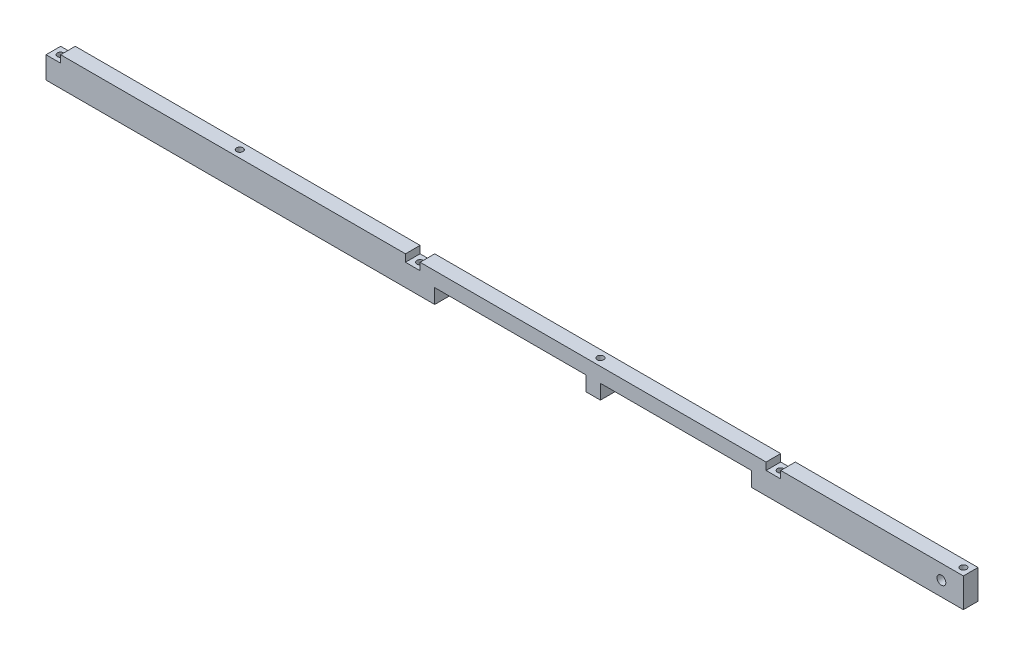
ISO-10303-21;
HEADER;
FILE_DESCRIPTION(('STEP AP214'),'2;1');
FILE_NAME('part.step','',(''),(''),'','','');
FILE_SCHEMA(('AUTOMOTIVE_DESIGN { 1 0 10303 214 1 1 1 1 }'));
ENDSEC;
DATA;
#1=APPLICATION_CONTEXT('core data for automotive mechanical design processes');
#2=APPLICATION_PROTOCOL_DEFINITION('international standard','automotive_design',2000,#1);
#3=PRODUCT_CONTEXT('',#1,'mechanical');
#4=PRODUCT('Part','Part','',(#3));
#5=PRODUCT_RELATED_PRODUCT_CATEGORY('part','',(#4));
#6=PRODUCT_DEFINITION_FORMATION('','',#4);
#7=PRODUCT_DEFINITION_CONTEXT('part definition',#1,'design');
#8=PRODUCT_DEFINITION('design','',#6,#7);
#9=PRODUCT_DEFINITION_SHAPE('','',#8);
#10=(LENGTH_UNIT() NAMED_UNIT(*) SI_UNIT(.MILLI.,.METRE.));
#11=(NAMED_UNIT(*) PLANE_ANGLE_UNIT() SI_UNIT($,.RADIAN.));
#12=(NAMED_UNIT(*) SI_UNIT($,.STERADIAN.) SOLID_ANGLE_UNIT());
#13=UNCERTAINTY_MEASURE_WITH_UNIT(LENGTH_MEASURE(1.E-05),#10,'distance_accuracy_value','');
#14=(GEOMETRIC_REPRESENTATION_CONTEXT(3) GLOBAL_UNCERTAINTY_ASSIGNED_CONTEXT((#13)) GLOBAL_UNIT_ASSIGNED_CONTEXT((#10,
#11,#12)) REPRESENTATION_CONTEXT('',''));
#15=CARTESIAN_POINT('',(0.,0.,0.));
#16=DIRECTION('',(0.,0.,1.));
#17=DIRECTION('',(1.,0.,0.));
#18=AXIS2_PLACEMENT_3D('',#15,#16,#17);
#19=CARTESIAN_POINT('',(398.018,0.,0.));
#20=DIRECTION('',(0.,0.,-1.));
#21=DIRECTION('',(-1.,0.,0.));
#22=AXIS2_PLACEMENT_3D('',#19,#20,#21);
#23=PLANE('',#22);
#24=CARTESIAN_POINT('',(388.493,6.35,0.));
#25=DIRECTION('',(0.,0.,1.));
#26=DIRECTION('',(1.,0.,0.));
#27=AXIS2_PLACEMENT_3D('',#24,#25,#26);
#28=CIRCLE('',#27,1.89865);
#29=CARTESIAN_POINT('',(390.39165,6.35,0.));
#30=VERTEX_POINT('',#29);
#31=EDGE_CURVE('E234',#30,#30,#28,.T.);
#32=ORIENTED_EDGE('',*,*,#31,.F.);
#33=EDGE_LOOP('',(#32));
#34=FACE_BOUND('',#33,.T.);
#35=DIRECTION('',(0.,1.,0.));
#36=VECTOR('',#35,1.);
#37=CARTESIAN_POINT('',(240.538,-1.05138120432002E-12,0.));
#38=LINE('',#37,#36);
#39=CARTESIAN_POINT('',(240.538,0.,0.));
#40=VERTEX_POINT('',#39);
#41=CARTESIAN_POINT('',(240.538,6.34999999999999,0.));
#42=VERTEX_POINT('',#41);
#43=EDGE_CURVE('E188',#40,#42,#38,.T.);
#44=ORIENTED_EDGE('',*,*,#43,.T.);
#45=DIRECTION('',(-1.,0.,0.));
#46=VECTOR('',#45,1.);
#47=CARTESIAN_POINT('',(0.,6.34999999999996,0.));
#48=LINE('',#47,#46);
#49=CARTESIAN_POINT('',(306.07,6.35,0.));
#50=VERTEX_POINT('',#49);
#51=EDGE_CURVE('E198',#50,#42,#48,.T.);
#52=ORIENTED_EDGE('',*,*,#51,.F.);
#53=DIRECTION('',(0.,1.,0.));
#54=VECTOR('',#53,1.);
#55=CARTESIAN_POINT('',(306.07,0.,0.));
#56=LINE('',#55,#54);
#57=CARTESIAN_POINT('',(306.07,0.,0.));
#58=VERTEX_POINT('',#57);
#59=EDGE_CURVE('E203',#58,#50,#56,.T.);
#60=ORIENTED_EDGE('',*,*,#59,.F.);
#61=DIRECTION('',(-1.,0.,0.));
#62=VECTOR('',#61,1.);
#63=CARTESIAN_POINT('',(398.018,0.,0.));
#64=LINE('',#63,#62);
#65=CARTESIAN_POINT('',(398.018,0.,0.));
#66=VERTEX_POINT('',#65);
#67=EDGE_CURVE('E368',#66,#58,#64,.T.);
#68=ORIENTED_EDGE('',*,*,#67,.F.);
#69=DIRECTION('',(0.,-1.,0.));
#70=VECTOR('',#69,1.);
#71=CARTESIAN_POINT('',(398.018,0.,0.));
#72=LINE('',#71,#70);
#73=CARTESIAN_POINT('',(398.018,12.7,0.));
#74=VERTEX_POINT('',#73);
#75=EDGE_CURVE('E335',#74,#66,#72,.T.);
#76=ORIENTED_EDGE('',*,*,#75,.F.);
#77=DIRECTION('',(-1.,0.,0.));
#78=VECTOR('',#77,1.);
#79=CARTESIAN_POINT('',(398.018,12.7,0.));
#80=LINE('',#79,#78);
#81=CARTESIAN_POINT('',(318.77,12.7,0.));
#82=VERTEX_POINT('',#81);
#83=EDGE_CURVE('E353',#74,#82,#80,.T.);
#84=ORIENTED_EDGE('',*,*,#83,.T.);
#85=DIRECTION('',(0.,1.,0.));
#86=VECTOR('',#85,1.);
#87=CARTESIAN_POINT('',(318.77,9.525,0.));
#88=LINE('',#87,#86);
#89=CARTESIAN_POINT('',(318.77,9.525,0.));
#90=VERTEX_POINT('',#89);
#91=EDGE_CURVE('E296',#90,#82,#88,.T.);
#92=ORIENTED_EDGE('',*,*,#91,.F.);
#93=DIRECTION('',(1.,0.,0.));
#94=VECTOR('',#93,1.);
#95=CARTESIAN_POINT('',(312.42,9.525,0.));
#96=LINE('',#95,#94);
#97=CARTESIAN_POINT('',(312.42,9.525,0.));
#98=VERTEX_POINT('',#97);
#99=EDGE_CURVE('E289',#98,#90,#96,.T.);
#100=ORIENTED_EDGE('',*,*,#99,.F.);
#101=DIRECTION('',(0.,-1.,0.));
#102=VECTOR('',#101,1.);
#103=CARTESIAN_POINT('',(312.42,9.525,0.));
#104=LINE('',#103,#102);
#105=CARTESIAN_POINT('',(312.42,12.7,0.));
#106=VERTEX_POINT('',#105);
#107=EDGE_CURVE('E298',#106,#98,#104,.T.);
#108=ORIENTED_EDGE('',*,*,#107,.F.);
#109=CARTESIAN_POINT('',(162.306,12.7,0.));
#110=VERTEX_POINT('',#109);
#111=EDGE_CURVE('E357',#106,#110,#80,.T.);
#112=ORIENTED_EDGE('',*,*,#111,.T.);
#113=DIRECTION('',(0.,1.,0.));
#114=VECTOR('',#113,1.);
#115=CARTESIAN_POINT('',(162.306,9.52500000000001,0.));
#116=LINE('',#115,#114);
#117=CARTESIAN_POINT('',(162.306,9.52500000000001,0.));
#118=VERTEX_POINT('',#117);
#119=EDGE_CURVE('E274',#118,#110,#116,.T.);
#120=ORIENTED_EDGE('',*,*,#119,.F.);
#121=DIRECTION('',(1.,0.,0.));
#122=VECTOR('',#121,1.);
#123=CARTESIAN_POINT('',(155.956,9.52500000000001,0.));
#124=LINE('',#123,#122);
#125=CARTESIAN_POINT('',(155.956,9.52500000000001,0.));
#126=VERTEX_POINT('',#125);
#127=EDGE_CURVE('E267',#126,#118,#124,.T.);
#128=ORIENTED_EDGE('',*,*,#127,.F.);
#129=DIRECTION('',(0.,-1.,0.));
#130=VECTOR('',#129,1.);
#131=CARTESIAN_POINT('',(155.956,9.52500000000001,0.));
#132=LINE('',#131,#130);
#133=CARTESIAN_POINT('',(155.956,12.7,0.));
#134=VERTEX_POINT('',#133);
#135=EDGE_CURVE('E276',#134,#126,#132,.T.);
#136=ORIENTED_EDGE('',*,*,#135,.F.);
#137=CARTESIAN_POINT('',(6.34999999999999,12.7,0.));
#138=VERTEX_POINT('',#137);
#139=EDGE_CURVE('E345',#134,#138,#80,.T.);
#140=ORIENTED_EDGE('',*,*,#139,.T.);
#141=DIRECTION('',(0.,1.,0.));
#142=VECTOR('',#141,1.);
#143=CARTESIAN_POINT('',(6.34999999999999,9.525,0.));
#144=LINE('',#143,#142);
#145=CARTESIAN_POINT('',(6.34999999999999,9.525,0.));
#146=VERTEX_POINT('',#145);
#147=EDGE_CURVE('E247',#146,#138,#144,.T.);
#148=ORIENTED_EDGE('',*,*,#147,.F.);
#149=DIRECTION('',(1.,0.,0.));
#150=VECTOR('',#149,1.);
#151=CARTESIAN_POINT('',(0.,9.525,0.));
#152=LINE('',#151,#150);
#153=CARTESIAN_POINT('',(0.,9.525,0.));
#154=VERTEX_POINT('',#153);
#155=EDGE_CURVE('E252',#154,#146,#152,.T.);
#156=ORIENTED_EDGE('',*,*,#155,.F.);
#157=DIRECTION('',(0.,-1.,0.));
#158=VECTOR('',#157,1.);
#159=CARTESIAN_POINT('',(0.,0.,0.));
#160=LINE('',#159,#158);
#161=CARTESIAN_POINT('',(0.,0.,0.));
#162=VERTEX_POINT('',#161);
#163=EDGE_CURVE('E334',#154,#162,#160,.T.);
#164=ORIENTED_EDGE('',*,*,#163,.T.);
#165=CARTESIAN_POINT('',(168.656,0.,0.));
#166=VERTEX_POINT('',#165);
#167=EDGE_CURVE('E366',#166,#162,#64,.T.);
#168=ORIENTED_EDGE('',*,*,#167,.F.);
#169=DIRECTION('',(0.,1.,0.));
#170=VECTOR('',#169,1.);
#171=CARTESIAN_POINT('',(168.656,0.,0.));
#172=LINE('',#171,#170);
#173=CARTESIAN_POINT('',(168.656,6.34999999999999,0.));
#174=VERTEX_POINT('',#173);
#175=EDGE_CURVE('E208',#166,#174,#172,.T.);
#176=ORIENTED_EDGE('',*,*,#175,.T.);
#177=DIRECTION('',(-1.,0.,0.));
#178=VECTOR('',#177,1.);
#179=CARTESIAN_POINT('',(0.,6.34999999999997,0.));
#180=LINE('',#179,#178);
#181=CARTESIAN_POINT('',(234.188,6.35,0.));
#182=VERTEX_POINT('',#181);
#183=EDGE_CURVE('E223',#182,#174,#180,.T.);
#184=ORIENTED_EDGE('',*,*,#183,.F.);
#185=DIRECTION('',(0.,1.,0.));
#186=VECTOR('',#185,1.);
#187=CARTESIAN_POINT('',(234.188,0.,0.));
#188=LINE('',#187,#186);
#189=CARTESIAN_POINT('',(234.188,0.,0.));
#190=VERTEX_POINT('',#189);
#191=EDGE_CURVE('E211',#190,#182,#188,.T.);
#192=ORIENTED_EDGE('',*,*,#191,.F.);
#193=EDGE_CURVE('E207',#40,#190,#64,.T.);
#194=ORIENTED_EDGE('',*,*,#193,.F.);
#195=EDGE_LOOP('',(#44,#52,#60,#68,#76,#84,#92,#100,#108,#112,#120,#128,#136,#140,#148,#156,
#164,#168,#176,#184,#192,#194));
#196=FACE_BOUND('',#195,.T.);
#197=ADVANCED_FACE('F36',(#34,#196),#23,.F.);
#198=CARTESIAN_POINT('',(398.018,0.,-6.35));
#199=DIRECTION('',(0.,0.,1.));
#200=DIRECTION('',(1.,0.,0.));
#201=AXIS2_PLACEMENT_3D('',#198,#199,#200);
#202=PLANE('',#201);
#203=CARTESIAN_POINT('',(388.493,6.35,-6.35));
#204=DIRECTION('',(0.,0.,1.));
#205=DIRECTION('',(1.,0.,0.));
#206=AXIS2_PLACEMENT_3D('',#203,#204,#205);
#207=CIRCLE('',#206,1.89865);
#208=CARTESIAN_POINT('',(390.39165,6.35,-6.35));
#209=VERTEX_POINT('',#208);
#210=EDGE_CURVE('E244',#209,#209,#207,.T.);
#211=ORIENTED_EDGE('',*,*,#210,.T.);
#212=EDGE_LOOP('',(#211));
#213=FACE_BOUND('',#212,.T.);
#214=DIRECTION('',(0.,1.,0.));
#215=VECTOR('',#214,1.);
#216=CARTESIAN_POINT('',(240.538,-1.05138120432002E-12,-6.35));
#217=LINE('',#216,#215);
#218=CARTESIAN_POINT('',(240.538,0.,-6.35));
#219=VERTEX_POINT('',#218);
#220=CARTESIAN_POINT('',(240.538,6.34999999999999,-6.35));
#221=VERTEX_POINT('',#220);
#222=EDGE_CURVE('E191',#219,#221,#217,.T.);
#223=ORIENTED_EDGE('',*,*,#222,.F.);
#224=DIRECTION('',(-1.,0.,0.));
#225=VECTOR('',#224,1.);
#226=CARTESIAN_POINT('',(398.018,0.,-6.35));
#227=LINE('',#226,#225);
#228=CARTESIAN_POINT('',(234.188,0.,-6.35));
#229=VERTEX_POINT('',#228);
#230=EDGE_CURVE('E367',#219,#229,#227,.T.);
#231=ORIENTED_EDGE('',*,*,#230,.T.);
#232=DIRECTION('',(0.,1.,0.));
#233=VECTOR('',#232,1.);
#234=CARTESIAN_POINT('',(234.188,0.,-6.35));
#235=LINE('',#234,#233);
#236=CARTESIAN_POINT('',(234.188,6.35,-6.35));
#237=VERTEX_POINT('',#236);
#238=EDGE_CURVE('E222',#229,#237,#235,.T.);
#239=ORIENTED_EDGE('',*,*,#238,.T.);
#240=DIRECTION('',(-1.,0.,0.));
#241=VECTOR('',#240,1.);
#242=CARTESIAN_POINT('',(0.,6.34999999999997,-6.35));
#243=LINE('',#242,#241);
#244=CARTESIAN_POINT('',(168.656,6.34999999999999,-6.35));
#245=VERTEX_POINT('',#244);
#246=EDGE_CURVE('E58',#237,#245,#243,.T.);
#247=ORIENTED_EDGE('',*,*,#246,.T.);
#248=DIRECTION('',(0.,1.,0.));
#249=VECTOR('',#248,1.);
#250=CARTESIAN_POINT('',(168.656,0.,-6.35));
#251=LINE('',#250,#249);
#252=CARTESIAN_POINT('',(168.656,0.,-6.35));
#253=VERTEX_POINT('',#252);
#254=EDGE_CURVE('E220',#253,#245,#251,.T.);
#255=ORIENTED_EDGE('',*,*,#254,.F.);
#256=CARTESIAN_POINT('',(0.,0.,-6.35));
#257=VERTEX_POINT('',#256);
#258=EDGE_CURVE('E361',#253,#257,#227,.T.);
#259=ORIENTED_EDGE('',*,*,#258,.T.);
#260=DIRECTION('',(0.,1.,0.));
#261=VECTOR('',#260,1.);
#262=CARTESIAN_POINT('',(0.,0.,-6.35));
#263=LINE('',#262,#261);
#264=CARTESIAN_POINT('',(0.,9.525,-6.35));
#265=VERTEX_POINT('',#264);
#266=EDGE_CURVE('E339',#257,#265,#263,.T.);
#267=ORIENTED_EDGE('',*,*,#266,.T.);
#268=DIRECTION('',(1.,0.,0.));
#269=VECTOR('',#268,1.);
#270=CARTESIAN_POINT('',(0.,9.525,-6.35));
#271=LINE('',#270,#269);
#272=CARTESIAN_POINT('',(6.34999999999999,9.525,-6.35));
#273=VERTEX_POINT('',#272);
#274=EDGE_CURVE('E251',#265,#273,#271,.T.);
#275=ORIENTED_EDGE('',*,*,#274,.T.);
#276=DIRECTION('',(0.,1.,0.));
#277=VECTOR('',#276,1.);
#278=CARTESIAN_POINT('',(6.34999999999999,9.525,-6.35));
#279=LINE('',#278,#277);
#280=CARTESIAN_POINT('',(6.34999999999999,12.7,-6.35));
#281=VERTEX_POINT('',#280);
#282=EDGE_CURVE('E248',#273,#281,#279,.T.);
#283=ORIENTED_EDGE('',*,*,#282,.T.);
#284=DIRECTION('',(-1.,0.,0.));
#285=VECTOR('',#284,1.);
#286=CARTESIAN_POINT('',(398.018,12.7,-6.35));
#287=LINE('',#286,#285);
#288=CARTESIAN_POINT('',(155.956,12.7,-6.35));
#289=VERTEX_POINT('',#288);
#290=EDGE_CURVE('E356',#289,#281,#287,.T.);
#291=ORIENTED_EDGE('',*,*,#290,.F.);
#292=DIRECTION('',(0.,-1.,0.));
#293=VECTOR('',#292,1.);
#294=CARTESIAN_POINT('',(155.956,9.52500000000001,-6.35));
#295=LINE('',#294,#293);
#296=CARTESIAN_POINT('',(155.956,9.52500000000001,-6.35));
#297=VERTEX_POINT('',#296);
#298=EDGE_CURVE('E266',#289,#297,#295,.T.);
#299=ORIENTED_EDGE('',*,*,#298,.T.);
#300=DIRECTION('',(1.,0.,0.));
#301=VECTOR('',#300,1.);
#302=CARTESIAN_POINT('',(155.956,9.52500000000001,-6.35));
#303=LINE('',#302,#301);
#304=CARTESIAN_POINT('',(162.306,9.52500000000001,-6.35));
#305=VERTEX_POINT('',#304);
#306=EDGE_CURVE('E270',#297,#305,#303,.T.);
#307=ORIENTED_EDGE('',*,*,#306,.T.);
#308=DIRECTION('',(0.,1.,0.));
#309=VECTOR('',#308,1.);
#310=CARTESIAN_POINT('',(162.306,9.52500000000001,-6.35));
#311=LINE('',#310,#309);
#312=CARTESIAN_POINT('',(162.306,12.7,-6.35));
#313=VERTEX_POINT('',#312);
#314=EDGE_CURVE('E263',#305,#313,#311,.T.);
#315=ORIENTED_EDGE('',*,*,#314,.T.);
#316=CARTESIAN_POINT('',(312.42,12.7,-6.35));
#317=VERTEX_POINT('',#316);
#318=EDGE_CURVE('E362',#317,#313,#287,.T.);
#319=ORIENTED_EDGE('',*,*,#318,.F.);
#320=DIRECTION('',(0.,-1.,0.));
#321=VECTOR('',#320,1.);
#322=CARTESIAN_POINT('',(312.42,9.525,-6.35));
#323=LINE('',#322,#321);
#324=CARTESIAN_POINT('',(312.42,9.525,-6.35));
#325=VERTEX_POINT('',#324);
#326=EDGE_CURVE('E288',#317,#325,#323,.T.);
#327=ORIENTED_EDGE('',*,*,#326,.T.);
#328=DIRECTION('',(1.,0.,0.));
#329=VECTOR('',#328,1.);
#330=CARTESIAN_POINT('',(312.42,9.525,-6.35));
#331=LINE('',#330,#329);
#332=CARTESIAN_POINT('',(318.77,9.525,-6.35));
#333=VERTEX_POINT('',#332);
#334=EDGE_CURVE('E292',#325,#333,#331,.T.);
#335=ORIENTED_EDGE('',*,*,#334,.T.);
#336=DIRECTION('',(0.,1.,0.));
#337=VECTOR('',#336,1.);
#338=CARTESIAN_POINT('',(318.77,9.525,-6.35));
#339=LINE('',#338,#337);
#340=CARTESIAN_POINT('',(318.77,12.7,-6.35));
#341=VERTEX_POINT('',#340);
#342=EDGE_CURVE('E285',#333,#341,#339,.T.);
#343=ORIENTED_EDGE('',*,*,#342,.T.);
#344=CARTESIAN_POINT('',(398.018,12.7,-6.35));
#345=VERTEX_POINT('',#344);
#346=EDGE_CURVE('E358',#345,#341,#287,.T.);
#347=ORIENTED_EDGE('',*,*,#346,.F.);
#348=DIRECTION('',(0.,1.,0.));
#349=VECTOR('',#348,1.);
#350=CARTESIAN_POINT('',(398.018,0.,-6.35));
#351=LINE('',#350,#349);
#352=CARTESIAN_POINT('',(398.018,0.,-6.35));
#353=VERTEX_POINT('',#352);
#354=EDGE_CURVE('E341',#353,#345,#351,.T.);
#355=ORIENTED_EDGE('',*,*,#354,.F.);
#356=CARTESIAN_POINT('',(306.07,0.,-6.35));
#357=VERTEX_POINT('',#356);
#358=EDGE_CURVE('E363',#353,#357,#227,.T.);
#359=ORIENTED_EDGE('',*,*,#358,.T.);
#360=DIRECTION('',(0.,1.,0.));
#361=VECTOR('',#360,1.);
#362=CARTESIAN_POINT('',(306.07,0.,-6.35));
#363=LINE('',#362,#361);
#364=CARTESIAN_POINT('',(306.07,6.35,-6.35));
#365=VERTEX_POINT('',#364);
#366=EDGE_CURVE('E50',#357,#365,#363,.T.);
#367=ORIENTED_EDGE('',*,*,#366,.T.);
#368=DIRECTION('',(-1.,0.,0.));
#369=VECTOR('',#368,1.);
#370=CARTESIAN_POINT('',(0.,6.34999999999996,-6.35));
#371=LINE('',#370,#369);
#372=EDGE_CURVE('E215',#365,#221,#371,.T.);
#373=ORIENTED_EDGE('',*,*,#372,.T.);
#374=EDGE_LOOP('',(#223,#231,#239,#247,#255,#259,#267,#275,#283,#291,#299,#307,#315,#319,#327,
#335,#343,#347,#355,#359,#367,#373));
#375=FACE_BOUND('',#374,.T.);
#376=ADVANCED_FACE('F408',(#213,#375),#202,.F.);
#377=CARTESIAN_POINT('',(398.018,0.,0.));
#378=DIRECTION('',(0.,1.,0.));
#379=DIRECTION('',(0.,0.,1.));
#380=AXIS2_PLACEMENT_3D('',#377,#378,#379);
#381=PLANE('',#380);
#382=CARTESIAN_POINT('',(237.363,0.,-3.175));
#383=DIRECTION('',(0.,1.,0.));
#384=DIRECTION('',(0.,0.,1.));
#385=AXIS2_PLACEMENT_3D('',#382,#383,#384);
#386=CIRCLE('',#385,1.40969999999999);
#387=CARTESIAN_POINT('',(237.363,0.,-1.76530000000001));
#388=VERTEX_POINT('',#387);
#389=EDGE_CURVE('E322',#388,#388,#386,.T.);
#390=ORIENTED_EDGE('',*,*,#389,.T.);
#391=EDGE_LOOP('',(#390));
#392=FACE_BOUND('',#391,.T.);
#393=DIRECTION('',(0.,0.,1.));
#394=VECTOR('',#393,1.);
#395=CARTESIAN_POINT('',(240.538,0.,-6.35));
#396=LINE('',#395,#394);
#397=EDGE_CURVE('E217',#219,#40,#396,.T.);
#398=ORIENTED_EDGE('',*,*,#397,.T.);
#399=ORIENTED_EDGE('',*,*,#193,.T.);
#400=DIRECTION('',(0.,0.,1.));
#401=VECTOR('',#400,1.);
#402=CARTESIAN_POINT('',(234.188,0.,-6.35));
#403=LINE('',#402,#401);
#404=EDGE_CURVE('E237',#229,#190,#403,.T.);
#405=ORIENTED_EDGE('',*,*,#404,.F.);
#406=ORIENTED_EDGE('',*,*,#230,.F.);
#407=EDGE_LOOP('',(#398,#399,#405,#406));
#408=FACE_BOUND('',#407,.T.);
#409=ADVANCED_FACE('F413',(#392,#408),#381,.F.);
#410=CARTESIAN_POINT('',(3.175,0.,-3.175));
#411=DIRECTION('',(0.,1.,0.));
#412=DIRECTION('',(0.,0.,1.));
#413=AXIS2_PLACEMENT_3D('',#410,#411,#412);
#414=CIRCLE('',#413,1.4097);
#415=CARTESIAN_POINT('',(3.175,0.,-1.7653));
#416=VERTEX_POINT('',#415);
#417=EDGE_CURVE('E307',#416,#416,#414,.T.);
#418=ORIENTED_EDGE('',*,*,#417,.T.);
#419=EDGE_LOOP('',(#418));
#420=FACE_BOUND('',#419,.T.);
#421=CARTESIAN_POINT('',(159.131,0.,-3.175));
#422=DIRECTION('',(0.,1.,0.));
#423=DIRECTION('',(0.,0.,1.));
#424=AXIS2_PLACEMENT_3D('',#421,#422,#423);
#425=CIRCLE('',#424,1.40969999999999);
#426=CARTESIAN_POINT('',(159.131,0.,-1.76530000000001));
#427=VERTEX_POINT('',#426);
#428=EDGE_CURVE('E310',#427,#427,#425,.T.);
#429=ORIENTED_EDGE('',*,*,#428,.T.);
#430=EDGE_LOOP('',(#429));
#431=FACE_BOUND('',#430,.T.);
#432=CARTESIAN_POINT('',(80.899,0.,-3.175));
#433=DIRECTION('',(0.,1.,0.));
#434=DIRECTION('',(0.,0.,1.));
#435=AXIS2_PLACEMENT_3D('',#432,#433,#434);
#436=CIRCLE('',#435,1.4097);
#437=CARTESIAN_POINT('',(80.899,0.,-1.7653));
#438=VERTEX_POINT('',#437);
#439=EDGE_CURVE('E316',#438,#438,#436,.T.);
#440=ORIENTED_EDGE('',*,*,#439,.T.);
#441=EDGE_LOOP('',(#440));
#442=FACE_BOUND('',#441,.T.);
#443=DIRECTION('',(0.,0.,1.));
#444=VECTOR('',#443,1.);
#445=CARTESIAN_POINT('',(168.656,0.,-6.35));
#446=LINE('',#445,#444);
#447=EDGE_CURVE('E226',#253,#166,#446,.T.);
#448=ORIENTED_EDGE('',*,*,#447,.T.);
#449=ORIENTED_EDGE('',*,*,#167,.T.);
#450=DIRECTION('',(0.,0.,-1.));
#451=VECTOR('',#450,1.);
#452=CARTESIAN_POINT('',(0.,0.,0.));
#453=LINE('',#452,#451);
#454=EDGE_CURVE('E348',#162,#257,#453,.T.);
#455=ORIENTED_EDGE('',*,*,#454,.T.);
#456=ORIENTED_EDGE('',*,*,#258,.F.);
#457=EDGE_LOOP('',(#448,#449,#455,#456));
#458=FACE_BOUND('',#457,.T.);
#459=ADVANCED_FACE('F421',(#420,#431,#442,#458),#381,.F.);
#460=CARTESIAN_POINT('',(398.018,12.7,0.));
#461=DIRECTION('',(0.,-1.,0.));
#462=DIRECTION('',(0.,0.,-1.));
#463=AXIS2_PLACEMENT_3D('',#460,#461,#462);
#464=PLANE('',#463);
#465=CARTESIAN_POINT('',(237.363,12.7,-3.175));
#466=DIRECTION('',(0.,1.,0.));
#467=DIRECTION('',(0.,0.,1.));
#468=AXIS2_PLACEMENT_3D('',#465,#466,#467);
#469=CIRCLE('',#468,1.40969999999999);
#470=CARTESIAN_POINT('',(237.363,12.7,-1.76530000000001));
#471=VERTEX_POINT('',#470);
#472=EDGE_CURVE('E319',#471,#471,#469,.T.);
#473=ORIENTED_EDGE('',*,*,#472,.F.);
#474=EDGE_LOOP('',(#473));
#475=FACE_BOUND('',#474,.T.);
#476=ORIENTED_EDGE('',*,*,#318,.T.);
#477=DIRECTION('',(0.,0.,1.));
#478=VECTOR('',#477,1.);
#479=CARTESIAN_POINT('',(162.306,12.7,0.));
#480=LINE('',#479,#478);
#481=EDGE_CURVE('E43',#313,#110,#480,.T.);
#482=ORIENTED_EDGE('',*,*,#481,.T.);
#483=ORIENTED_EDGE('',*,*,#111,.F.);
#484=DIRECTION('',(0.,0.,-1.));
#485=VECTOR('',#484,1.);
#486=CARTESIAN_POINT('',(312.42,12.7,0.));
#487=LINE('',#486,#485);
#488=EDGE_CURVE('E371',#106,#317,#487,.T.);
#489=ORIENTED_EDGE('',*,*,#488,.T.);
#490=EDGE_LOOP('',(#476,#482,#483,#489));
#491=FACE_BOUND('',#490,.T.);
#492=ADVANCED_FACE('F437',(#475,#491),#464,.F.);
#493=CARTESIAN_POINT('',(394.843,12.7,-3.175));
#494=DIRECTION('',(0.,1.,0.));
#495=DIRECTION('',(0.,0.,1.));
#496=AXIS2_PLACEMENT_3D('',#493,#494,#495);
#497=CIRCLE('',#496,1.40970000000001);
#498=CARTESIAN_POINT('',(394.843,12.7,-1.76529999999999));
#499=VERTEX_POINT('',#498);
#500=EDGE_CURVE('E328',#499,#499,#497,.T.);
#501=ORIENTED_EDGE('',*,*,#500,.F.);
#502=EDGE_LOOP('',(#501));
#503=FACE_BOUND('',#502,.T.);
#504=ORIENTED_EDGE('',*,*,#346,.T.);
#505=DIRECTION('',(0.,0.,1.));
#506=VECTOR('',#505,1.);
#507=CARTESIAN_POINT('',(318.77,12.7,0.));
#508=LINE('',#507,#506);
#509=EDGE_CURVE('E376',#341,#82,#508,.T.);
#510=ORIENTED_EDGE('',*,*,#509,.T.);
#511=ORIENTED_EDGE('',*,*,#83,.F.);
#512=DIRECTION('',(0.,0.,1.));
#513=VECTOR('',#512,1.);
#514=CARTESIAN_POINT('',(398.018,12.7,0.));
#515=LINE('',#514,#513);
#516=EDGE_CURVE('E343',#345,#74,#515,.T.);
#517=ORIENTED_EDGE('',*,*,#516,.F.);
#518=EDGE_LOOP('',(#504,#510,#511,#517));
#519=FACE_BOUND('',#518,.T.);
#520=ADVANCED_FACE('F429',(#503,#519),#464,.F.);
#521=CARTESIAN_POINT('',(315.595,0.,-3.175));
#522=DIRECTION('',(0.,1.,0.));
#523=DIRECTION('',(0.,0.,1.));
#524=AXIS2_PLACEMENT_3D('',#521,#522,#523);
#525=CIRCLE('',#524,1.40970000000001);
#526=CARTESIAN_POINT('',(315.595,0.,-1.76529999999999));
#527=VERTEX_POINT('',#526);
#528=EDGE_CURVE('E325',#527,#527,#525,.T.);
#529=ORIENTED_EDGE('',*,*,#528,.T.);
#530=EDGE_LOOP('',(#529));
#531=FACE_BOUND('',#530,.T.);
#532=CARTESIAN_POINT('',(394.843,0.,-3.175));
#533=DIRECTION('',(0.,1.,0.));
#534=DIRECTION('',(0.,0.,1.));
#535=AXIS2_PLACEMENT_3D('',#532,#533,#534);
#536=CIRCLE('',#535,1.40970000000001);
#537=CARTESIAN_POINT('',(394.843,0.,-1.76529999999999));
#538=VERTEX_POINT('',#537);
#539=EDGE_CURVE('E331',#538,#538,#536,.T.);
#540=ORIENTED_EDGE('',*,*,#539,.T.);
#541=EDGE_LOOP('',(#540));
#542=FACE_BOUND('',#541,.T.);
#543=ORIENTED_EDGE('',*,*,#67,.T.);
#544=DIRECTION('',(0.,0.,1.));
#545=VECTOR('',#544,1.);
#546=CARTESIAN_POINT('',(306.07,0.,-6.35));
#547=LINE('',#546,#545);
#548=EDGE_CURVE('E511',#357,#58,#547,.T.);
#549=ORIENTED_EDGE('',*,*,#548,.F.);
#550=ORIENTED_EDGE('',*,*,#358,.F.);
#551=DIRECTION('',(0.,0.,-1.));
#552=VECTOR('',#551,1.);
#553=CARTESIAN_POINT('',(398.018,0.,0.));
#554=LINE('',#553,#552);
#555=EDGE_CURVE('E338',#66,#353,#554,.T.);
#556=ORIENTED_EDGE('',*,*,#555,.F.);
#557=EDGE_LOOP('',(#543,#549,#550,#556));
#558=FACE_BOUND('',#557,.T.);
#559=ADVANCED_FACE('F423',(#531,#542,#558),#381,.F.);
#560=CARTESIAN_POINT('',(80.899,12.7,-3.175));
#561=DIRECTION('',(0.,1.,0.));
#562=DIRECTION('',(0.,0.,1.));
#563=AXIS2_PLACEMENT_3D('',#560,#561,#562);
#564=CIRCLE('',#563,1.40969999999999);
#565=CARTESIAN_POINT('',(80.899,12.7,-1.76530000000001));
#566=VERTEX_POINT('',#565);
#567=EDGE_CURVE('E313',#566,#566,#564,.T.);
#568=ORIENTED_EDGE('',*,*,#567,.F.);
#569=EDGE_LOOP('',(#568));
#570=FACE_BOUND('',#569,.T.);
#571=ORIENTED_EDGE('',*,*,#290,.T.);
#572=DIRECTION('',(0.,0.,1.));
#573=VECTOR('',#572,1.);
#574=CARTESIAN_POINT('',(6.34999999999997,12.7,0.));
#575=LINE('',#574,#573);
#576=EDGE_CURVE('E11',#281,#138,#575,.T.);
#577=ORIENTED_EDGE('',*,*,#576,.T.);
#578=ORIENTED_EDGE('',*,*,#139,.F.);
#579=DIRECTION('',(0.,0.,-1.));
#580=VECTOR('',#579,1.);
#581=CARTESIAN_POINT('',(155.956,12.7,0.));
#582=LINE('',#581,#580);
#583=EDGE_CURVE('E379',#134,#289,#582,.T.);
#584=ORIENTED_EDGE('',*,*,#583,.T.);
#585=EDGE_LOOP('',(#571,#577,#578,#584));
#586=FACE_BOUND('',#585,.T.);
#587=ADVANCED_FACE('F426',(#570,#586),#464,.F.);
#588=CARTESIAN_POINT('',(398.018,0.,0.));
#589=DIRECTION('',(-1.,0.,0.));
#590=DIRECTION('',(0.,0.,1.));
#591=AXIS2_PLACEMENT_3D('',#588,#589,#590);
#592=PLANE('',#591);
#593=ORIENTED_EDGE('',*,*,#75,.T.);
#594=ORIENTED_EDGE('',*,*,#555,.T.);
#595=ORIENTED_EDGE('',*,*,#354,.T.);
#596=ORIENTED_EDGE('',*,*,#516,.T.);
#597=EDGE_LOOP('',(#593,#594,#595,#596));
#598=FACE_BOUND('',#597,.T.);
#599=ADVANCED_FACE('F435',(#598),#592,.F.);
#600=CARTESIAN_POINT('',(0.,0.,0.));
#601=DIRECTION('',(-1.,0.,0.));
#602=DIRECTION('',(0.,0.,1.));
#603=AXIS2_PLACEMENT_3D('',#600,#601,#602);
#604=PLANE('',#603);
#605=DIRECTION('',(0.,0.,1.));
#606=VECTOR('',#605,1.);
#607=CARTESIAN_POINT('',(0.,9.525,-6.35));
#608=LINE('',#607,#606);
#609=EDGE_CURVE('E255',#265,#154,#608,.T.);
#610=ORIENTED_EDGE('',*,*,#609,.F.);
#611=ORIENTED_EDGE('',*,*,#266,.F.);
#612=ORIENTED_EDGE('',*,*,#454,.F.);
#613=ORIENTED_EDGE('',*,*,#163,.F.);
#614=EDGE_LOOP('',(#610,#611,#612,#613));
#615=FACE_BOUND('',#614,.T.);
#616=ADVANCED_FACE('F470',(#615),#604,.T.);
#617=CARTESIAN_POINT('',(394.843,12.7,-3.175));
#618=DIRECTION('',(0.,1.,0.));
#619=DIRECTION('',(0.,0.,1.));
#620=AXIS2_PLACEMENT_3D('',#617,#618,#619);
#621=CYLINDRICAL_SURFACE('',#620,1.40970000000001);
#622=ORIENTED_EDGE('',*,*,#539,.F.);
#623=EDGE_LOOP('',(#622));
#624=FACE_BOUND('',#623,.T.);
#625=ORIENTED_EDGE('',*,*,#500,.T.);
#626=EDGE_LOOP('',(#625));
#627=FACE_BOUND('',#626,.T.);
#628=ADVANCED_FACE('F542',(#624,#627),#621,.F.);
#629=CARTESIAN_POINT('',(315.595,12.7,-3.175));
#630=DIRECTION('',(0.,1.,0.));
#631=DIRECTION('',(0.,0.,1.));
#632=AXIS2_PLACEMENT_3D('',#629,#630,#631);
#633=CYLINDRICAL_SURFACE('',#632,1.40970000000001);
#634=CARTESIAN_POINT('',(315.595,9.525,-3.175));
#635=DIRECTION('',(0.,-1.,0.));
#636=DIRECTION('',(0.,0.,-1.));
#637=AXIS2_PLACEMENT_3D('',#634,#635,#636);
#638=CIRCLE('',#637,1.40970000000001);
#639=CARTESIAN_POINT('',(315.595,9.525,-4.58470000000001));
#640=VERTEX_POINT('',#639);
#641=EDGE_CURVE('E304',#640,#640,#638,.F.);
#642=ORIENTED_EDGE('',*,*,#641,.T.);
#643=EDGE_LOOP('',(#642));
#644=FACE_BOUND('',#643,.T.);
#645=ORIENTED_EDGE('',*,*,#528,.F.);
#646=EDGE_LOOP('',(#645));
#647=FACE_BOUND('',#646,.T.);
#648=ADVANCED_FACE('F538',(#644,#647),#633,.F.);
#649=CARTESIAN_POINT('',(237.363,12.7,-3.175));
#650=DIRECTION('',(0.,1.,0.));
#651=DIRECTION('',(0.,0.,1.));
#652=AXIS2_PLACEMENT_3D('',#649,#650,#651);
#653=CYLINDRICAL_SURFACE('',#652,1.40969999999999);
#654=ORIENTED_EDGE('',*,*,#389,.F.);
#655=EDGE_LOOP('',(#654));
#656=FACE_BOUND('',#655,.T.);
#657=ORIENTED_EDGE('',*,*,#472,.T.);
#658=EDGE_LOOP('',(#657));
#659=FACE_BOUND('',#658,.T.);
#660=ADVANCED_FACE('F534',(#656,#659),#653,.F.);
#661=CARTESIAN_POINT('',(80.899,12.7,-3.175));
#662=DIRECTION('',(0.,1.,0.));
#663=DIRECTION('',(0.,0.,1.));
#664=AXIS2_PLACEMENT_3D('',#661,#662,#663);
#665=CYLINDRICAL_SURFACE('',#664,1.40969999999999);
#666=ORIENTED_EDGE('',*,*,#439,.F.);
#667=EDGE_LOOP('',(#666));
#668=FACE_BOUND('',#667,.T.);
#669=ORIENTED_EDGE('',*,*,#567,.T.);
#670=EDGE_LOOP('',(#669));
#671=FACE_BOUND('',#670,.T.);
#672=ADVANCED_FACE('F530',(#668,#671),#665,.F.);
#673=CARTESIAN_POINT('',(159.131,12.7,-3.175));
#674=DIRECTION('',(0.,1.,0.));
#675=DIRECTION('',(0.,0.,1.));
#676=AXIS2_PLACEMENT_3D('',#673,#674,#675);
#677=CYLINDRICAL_SURFACE('',#676,1.40969999999999);
#678=CARTESIAN_POINT('',(159.131,9.52500000000001,-3.175));
#679=DIRECTION('',(0.,-1.,0.));
#680=DIRECTION('',(0.,0.,-1.));
#681=AXIS2_PLACEMENT_3D('',#678,#679,#680);
#682=CIRCLE('',#681,1.40969999999999);
#683=CARTESIAN_POINT('',(159.131,9.52500000000001,-4.58469999999999));
#684=VERTEX_POINT('',#683);
#685=EDGE_CURVE('E282',#684,#684,#682,.F.);
#686=ORIENTED_EDGE('',*,*,#685,.T.);
#687=EDGE_LOOP('',(#686));
#688=FACE_BOUND('',#687,.T.);
#689=ORIENTED_EDGE('',*,*,#428,.F.);
#690=EDGE_LOOP('',(#689));
#691=FACE_BOUND('',#690,.T.);
#692=ADVANCED_FACE('F524',(#688,#691),#677,.F.);
#693=CARTESIAN_POINT('',(3.175,12.7,-3.175));
#694=DIRECTION('',(0.,1.,0.));
#695=DIRECTION('',(0.,0.,1.));
#696=AXIS2_PLACEMENT_3D('',#693,#694,#695);
#697=CYLINDRICAL_SURFACE('',#696,1.40969999999999);
#698=CARTESIAN_POINT('',(3.175,9.525,-3.175));
#699=DIRECTION('',(0.,-1.,0.));
#700=DIRECTION('',(0.,0.,-1.));
#701=AXIS2_PLACEMENT_3D('',#698,#699,#700);
#702=CIRCLE('',#701,1.40969999999999);
#703=CARTESIAN_POINT('',(3.175,9.525,-4.58469999999999));
#704=VERTEX_POINT('',#703);
#705=EDGE_CURVE('E261',#704,#704,#702,.F.);
#706=ORIENTED_EDGE('',*,*,#705,.T.);
#707=EDGE_LOOP('',(#706));
#708=FACE_BOUND('',#707,.T.);
#709=ORIENTED_EDGE('',*,*,#417,.F.);
#710=EDGE_LOOP('',(#709));
#711=FACE_BOUND('',#710,.T.);
#712=ADVANCED_FACE('F388',(#708,#711),#697,.F.);
#713=CARTESIAN_POINT('',(318.77,9.525,-6.35));
#714=DIRECTION('',(1.,0.,0.));
#715=DIRECTION('',(0.,0.,-1.));
#716=AXIS2_PLACEMENT_3D('',#713,#714,#715);
#717=PLANE('',#716);
#718=ORIENTED_EDGE('',*,*,#342,.F.);
#719=DIRECTION('',(0.,0.,1.));
#720=VECTOR('',#719,1.);
#721=CARTESIAN_POINT('',(318.77,9.525,-6.35));
#722=LINE('',#721,#720);
#723=EDGE_CURVE('E302',#333,#90,#722,.T.);
#724=ORIENTED_EDGE('',*,*,#723,.T.);
#725=ORIENTED_EDGE('',*,*,#91,.T.);
#726=ORIENTED_EDGE('',*,*,#509,.F.);
#727=EDGE_LOOP('',(#718,#724,#725,#726));
#728=FACE_BOUND('',#727,.T.);
#729=ADVANCED_FACE('F516',(#728),#717,.F.);
#730=CARTESIAN_POINT('',(312.42,9.525,-6.35));
#731=DIRECTION('',(-1.,0.,0.));
#732=DIRECTION('',(0.,0.,1.));
#733=AXIS2_PLACEMENT_3D('',#730,#731,#732);
#734=PLANE('',#733);
#735=ORIENTED_EDGE('',*,*,#107,.T.);
#736=DIRECTION('',(0.,0.,1.));
#737=VECTOR('',#736,1.);
#738=CARTESIAN_POINT('',(312.42,9.525,-6.35));
#739=LINE('',#738,#737);
#740=EDGE_CURVE('E295',#325,#98,#739,.T.);
#741=ORIENTED_EDGE('',*,*,#740,.F.);
#742=ORIENTED_EDGE('',*,*,#326,.F.);
#743=ORIENTED_EDGE('',*,*,#488,.F.);
#744=EDGE_LOOP('',(#735,#741,#742,#743));
#745=FACE_BOUND('',#744,.T.);
#746=ADVANCED_FACE('F494',(#745),#734,.F.);
#747=CARTESIAN_POINT('',(312.42,9.525,-6.35));
#748=DIRECTION('',(0.,-1.,0.));
#749=DIRECTION('',(0.,0.,-1.));
#750=AXIS2_PLACEMENT_3D('',#747,#748,#749);
#751=PLANE('',#750);
#752=ORIENTED_EDGE('',*,*,#99,.T.);
#753=ORIENTED_EDGE('',*,*,#723,.F.);
#754=ORIENTED_EDGE('',*,*,#334,.F.);
#755=ORIENTED_EDGE('',*,*,#740,.T.);
#756=EDGE_LOOP('',(#752,#753,#754,#755));
#757=FACE_BOUND('',#756,.T.);
#758=ORIENTED_EDGE('',*,*,#641,.F.);
#759=EDGE_LOOP('',(#758));
#760=FACE_BOUND('',#759,.T.);
#761=ADVANCED_FACE('F497',(#757,#760),#751,.F.);
#762=CARTESIAN_POINT('',(162.306,9.52500000000001,-6.35));
#763=DIRECTION('',(1.,0.,0.));
#764=DIRECTION('',(0.,0.,-1.));
#765=AXIS2_PLACEMENT_3D('',#762,#763,#764);
#766=PLANE('',#765);
#767=ORIENTED_EDGE('',*,*,#314,.F.);
#768=DIRECTION('',(0.,0.,1.));
#769=VECTOR('',#768,1.);
#770=CARTESIAN_POINT('',(162.306,9.52500000000001,-6.35));
#771=LINE('',#770,#769);
#772=EDGE_CURVE('E280',#305,#118,#771,.T.);
#773=ORIENTED_EDGE('',*,*,#772,.T.);
#774=ORIENTED_EDGE('',*,*,#119,.T.);
#775=ORIENTED_EDGE('',*,*,#481,.F.);
#776=EDGE_LOOP('',(#767,#773,#774,#775));
#777=FACE_BOUND('',#776,.T.);
#778=ADVANCED_FACE('F487',(#777),#766,.F.);
#779=CARTESIAN_POINT('',(155.956,9.52500000000001,-6.35));
#780=DIRECTION('',(-1.,0.,0.));
#781=DIRECTION('',(0.,0.,1.));
#782=AXIS2_PLACEMENT_3D('',#779,#780,#781);
#783=PLANE('',#782);
#784=ORIENTED_EDGE('',*,*,#135,.T.);
#785=DIRECTION('',(0.,0.,1.));
#786=VECTOR('',#785,1.);
#787=CARTESIAN_POINT('',(155.956,9.52500000000001,-6.35));
#788=LINE('',#787,#786);
#789=EDGE_CURVE('E273',#297,#126,#788,.T.);
#790=ORIENTED_EDGE('',*,*,#789,.F.);
#791=ORIENTED_EDGE('',*,*,#298,.F.);
#792=ORIENTED_EDGE('',*,*,#583,.F.);
#793=EDGE_LOOP('',(#784,#790,#791,#792));
#794=FACE_BOUND('',#793,.T.);
#795=ADVANCED_FACE('F607',(#794),#783,.F.);
#796=CARTESIAN_POINT('',(155.956,9.52500000000001,-6.35));
#797=DIRECTION('',(0.,-1.,0.));
#798=DIRECTION('',(0.,0.,-1.));
#799=AXIS2_PLACEMENT_3D('',#796,#797,#798);
#800=PLANE('',#799);
#801=ORIENTED_EDGE('',*,*,#127,.T.);
#802=ORIENTED_EDGE('',*,*,#772,.F.);
#803=ORIENTED_EDGE('',*,*,#306,.F.);
#804=ORIENTED_EDGE('',*,*,#789,.T.);
#805=EDGE_LOOP('',(#801,#802,#803,#804));
#806=FACE_BOUND('',#805,.T.);
#807=ORIENTED_EDGE('',*,*,#685,.F.);
#808=EDGE_LOOP('',(#807));
#809=FACE_BOUND('',#808,.T.);
#810=ADVANCED_FACE('F404',(#806,#809),#800,.F.);
#811=CARTESIAN_POINT('',(6.34999999999999,9.525,-6.35));
#812=DIRECTION('',(1.,0.,0.));
#813=DIRECTION('',(0.,0.,-1.));
#814=AXIS2_PLACEMENT_3D('',#811,#812,#813);
#815=PLANE('',#814);
#816=ORIENTED_EDGE('',*,*,#282,.F.);
#817=DIRECTION('',(0.,0.,1.));
#818=VECTOR('',#817,1.);
#819=CARTESIAN_POINT('',(6.34999999999999,9.525,-6.35));
#820=LINE('',#819,#818);
#821=EDGE_CURVE('E259',#273,#146,#820,.T.);
#822=ORIENTED_EDGE('',*,*,#821,.T.);
#823=ORIENTED_EDGE('',*,*,#147,.T.);
#824=ORIENTED_EDGE('',*,*,#576,.F.);
#825=EDGE_LOOP('',(#816,#822,#823,#824));
#826=FACE_BOUND('',#825,.T.);
#827=ADVANCED_FACE('F394',(#826),#815,.F.);
#828=CARTESIAN_POINT('',(0.,9.525,-6.35));
#829=DIRECTION('',(0.,-1.,0.));
#830=DIRECTION('',(0.,0.,-1.));
#831=AXIS2_PLACEMENT_3D('',#828,#829,#830);
#832=PLANE('',#831);
#833=ORIENTED_EDGE('',*,*,#155,.T.);
#834=ORIENTED_EDGE('',*,*,#821,.F.);
#835=ORIENTED_EDGE('',*,*,#274,.F.);
#836=ORIENTED_EDGE('',*,*,#609,.T.);
#837=EDGE_LOOP('',(#833,#834,#835,#836));
#838=FACE_BOUND('',#837,.T.);
#839=ORIENTED_EDGE('',*,*,#705,.F.);
#840=EDGE_LOOP('',(#839));
#841=FACE_BOUND('',#840,.T.);
#842=ADVANCED_FACE('F391',(#838,#841),#832,.F.);
#843=CARTESIAN_POINT('',(388.493,6.35,0.));
#844=DIRECTION('',(0.,0.,1.));
#845=DIRECTION('',(1.,0.,0.));
#846=AXIS2_PLACEMENT_3D('',#843,#844,#845);
#847=CYLINDRICAL_SURFACE('',#846,1.89865);
#848=ORIENTED_EDGE('',*,*,#210,.F.);
#849=EDGE_LOOP('',(#848));
#850=FACE_BOUND('',#849,.T.);
#851=ORIENTED_EDGE('',*,*,#31,.T.);
#852=EDGE_LOOP('',(#851));
#853=FACE_BOUND('',#852,.T.);
#854=ADVANCED_FACE('F393',(#850,#853),#847,.F.);
#855=CARTESIAN_POINT('',(168.656,0.,-6.35));
#856=DIRECTION('',(1.,0.,0.));
#857=DIRECTION('',(0.,0.,-1.));
#858=AXIS2_PLACEMENT_3D('',#855,#856,#857);
#859=PLANE('',#858);
#860=ORIENTED_EDGE('',*,*,#175,.F.);
#861=ORIENTED_EDGE('',*,*,#447,.F.);
#862=ORIENTED_EDGE('',*,*,#254,.T.);
#863=DIRECTION('',(0.,0.,1.));
#864=VECTOR('',#863,1.);
#865=CARTESIAN_POINT('',(168.656,6.34999999999999,-6.35));
#866=LINE('',#865,#864);
#867=EDGE_CURVE('E232',#245,#174,#866,.T.);
#868=ORIENTED_EDGE('',*,*,#867,.T.);
#869=EDGE_LOOP('',(#860,#861,#862,#868));
#870=FACE_BOUND('',#869,.T.);
#871=ADVANCED_FACE('F401',(#870),#859,.T.);
#872=CARTESIAN_POINT('',(0.,6.34999999999997,-6.35));
#873=DIRECTION('',(0.,1.,0.));
#874=DIRECTION('',(-1.,0.,0.));
#875=AXIS2_PLACEMENT_3D('',#872,#873,#874);
#876=PLANE('',#875);
#877=ORIENTED_EDGE('',*,*,#183,.T.);
#878=ORIENTED_EDGE('',*,*,#867,.F.);
#879=ORIENTED_EDGE('',*,*,#246,.F.);
#880=DIRECTION('',(0.,0.,1.));
#881=VECTOR('',#880,1.);
#882=CARTESIAN_POINT('',(234.188,6.35,-6.35));
#883=LINE('',#882,#881);
#884=EDGE_CURVE('E235',#237,#182,#883,.T.);
#885=ORIENTED_EDGE('',*,*,#884,.T.);
#886=EDGE_LOOP('',(#877,#878,#879,#885));
#887=FACE_BOUND('',#886,.T.);
#888=ADVANCED_FACE('F466',(#887),#876,.F.);
#889=CARTESIAN_POINT('',(234.188,0.,-6.35));
#890=DIRECTION('',(1.,0.,0.));
#891=DIRECTION('',(0.,0.,-1.));
#892=AXIS2_PLACEMENT_3D('',#889,#890,#891);
#893=PLANE('',#892);
#894=ORIENTED_EDGE('',*,*,#191,.T.);
#895=ORIENTED_EDGE('',*,*,#884,.F.);
#896=ORIENTED_EDGE('',*,*,#238,.F.);
#897=ORIENTED_EDGE('',*,*,#404,.T.);
#898=EDGE_LOOP('',(#894,#895,#896,#897));
#899=FACE_BOUND('',#898,.T.);
#900=ADVANCED_FACE('F465',(#899),#893,.F.);
#901=CARTESIAN_POINT('',(240.538,-1.05138120432002E-12,-6.35));
#902=DIRECTION('',(1.,0.,0.));
#903=DIRECTION('',(0.,1.,0.));
#904=AXIS2_PLACEMENT_3D('',#901,#902,#903);
#905=PLANE('',#904);
#906=ORIENTED_EDGE('',*,*,#43,.F.);
#907=ORIENTED_EDGE('',*,*,#397,.F.);
#908=ORIENTED_EDGE('',*,*,#222,.T.);
#909=DIRECTION('',(0.,0.,1.));
#910=VECTOR('',#909,1.);
#911=CARTESIAN_POINT('',(240.538,6.34999999999999,-6.35));
#912=LINE('',#911,#910);
#913=EDGE_CURVE('E184',#221,#42,#912,.T.);
#914=ORIENTED_EDGE('',*,*,#913,.T.);
#915=EDGE_LOOP('',(#906,#907,#908,#914));
#916=FACE_BOUND('',#915,.T.);
#917=ADVANCED_FACE('F186',(#916),#905,.T.);
#918=CARTESIAN_POINT('',(0.,6.34999999999996,-6.35));
#919=DIRECTION('',(0.,1.,0.));
#920=DIRECTION('',(-1.,0.,0.));
#921=AXIS2_PLACEMENT_3D('',#918,#919,#920);
#922=PLANE('',#921);
#923=ORIENTED_EDGE('',*,*,#51,.T.);
#924=ORIENTED_EDGE('',*,*,#913,.F.);
#925=ORIENTED_EDGE('',*,*,#372,.F.);
#926=DIRECTION('',(0.,0.,1.));
#927=VECTOR('',#926,1.);
#928=CARTESIAN_POINT('',(306.07,6.35,-6.35));
#929=LINE('',#928,#927);
#930=EDGE_CURVE('E195',#365,#50,#929,.T.);
#931=ORIENTED_EDGE('',*,*,#930,.T.);
#932=EDGE_LOOP('',(#923,#924,#925,#931));
#933=FACE_BOUND('',#932,.T.);
#934=ADVANCED_FACE('F199',(#933),#922,.F.);
#935=CARTESIAN_POINT('',(306.07,0.,-6.35));
#936=DIRECTION('',(1.,0.,0.));
#937=DIRECTION('',(0.,0.,-1.));
#938=AXIS2_PLACEMENT_3D('',#935,#936,#937);
#939=PLANE('',#938);
#940=ORIENTED_EDGE('',*,*,#59,.T.);
#941=ORIENTED_EDGE('',*,*,#930,.F.);
#942=ORIENTED_EDGE('',*,*,#366,.F.);
#943=ORIENTED_EDGE('',*,*,#548,.T.);
#944=EDGE_LOOP('',(#940,#941,#942,#943));
#945=FACE_BOUND('',#944,.T.);
#946=ADVANCED_FACE('F515',(#945),#939,.F.);
#947=CLOSED_SHELL('',(#197,#376,#409,#459,#492,#520,#559,#587,#599,#616,#628,#648,#660,#672,
#692,#712,#729,#746,#761,#778,#795,#810,#827,#842,#854,#871,#888,#900,#917,#934,#946));
#948=MANIFOLD_SOLID_BREP('B2',#947);
#949=ADVANCED_BREP_SHAPE_REPRESENTATION('',(#18,#948),#14);
#950=SHAPE_DEFINITION_REPRESENTATION(#9,#949);
ENDSEC;
END-ISO-10303-21;
